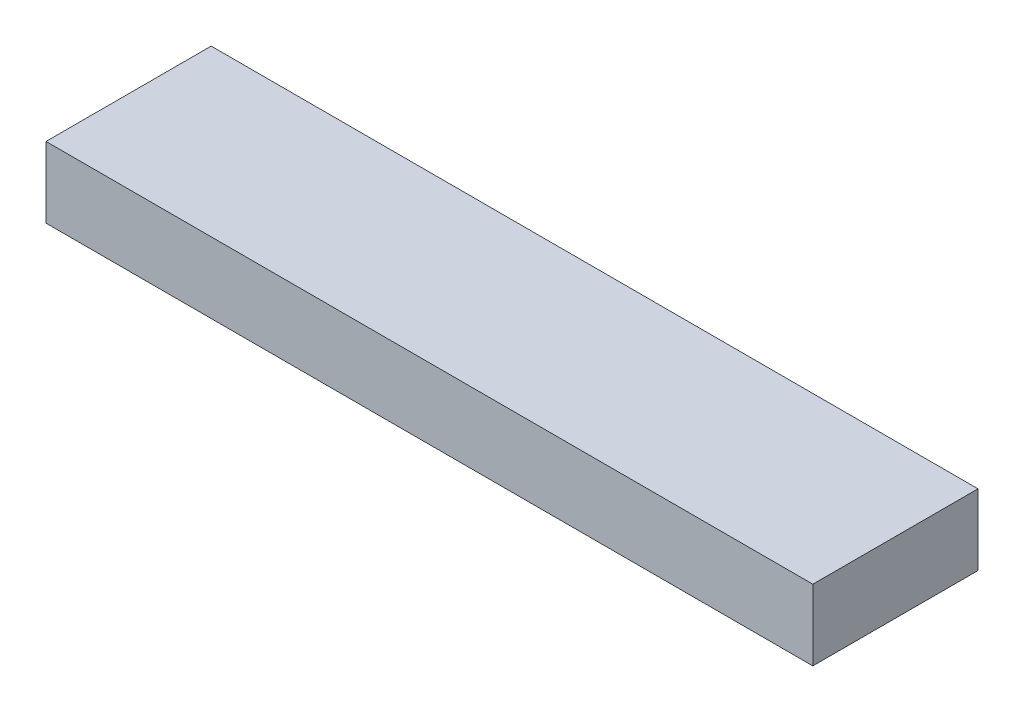
ISO-10303-21;
HEADER;
FILE_DESCRIPTION(('STEP AP214'),'2;1');
FILE_NAME('part.step','',(''),(''),'','','');
FILE_SCHEMA(('AUTOMOTIVE_DESIGN { 1 0 10303 214 1 1 1 1 }'));
ENDSEC;
DATA;
#1=APPLICATION_CONTEXT('core data for automotive mechanical design processes');
#2=APPLICATION_PROTOCOL_DEFINITION('international standard','automotive_design',2000,#1);
#3=PRODUCT_CONTEXT('',#1,'mechanical');
#4=PRODUCT('Part','Part','',(#3));
#5=PRODUCT_RELATED_PRODUCT_CATEGORY('part','',(#4));
#6=PRODUCT_DEFINITION_FORMATION('','',#4);
#7=PRODUCT_DEFINITION_CONTEXT('part definition',#1,'design');
#8=PRODUCT_DEFINITION('design','',#6,#7);
#9=PRODUCT_DEFINITION_SHAPE('','',#8);
#10=(LENGTH_UNIT() NAMED_UNIT(*) SI_UNIT(.MILLI.,.METRE.));
#11=(NAMED_UNIT(*) PLANE_ANGLE_UNIT() SI_UNIT($,.RADIAN.));
#12=(NAMED_UNIT(*) SI_UNIT($,.STERADIAN.) SOLID_ANGLE_UNIT());
#13=UNCERTAINTY_MEASURE_WITH_UNIT(LENGTH_MEASURE(1.E-05),#10,'distance_accuracy_value','');
#14=(GEOMETRIC_REPRESENTATION_CONTEXT(3) GLOBAL_UNCERTAINTY_ASSIGNED_CONTEXT((#13)) GLOBAL_UNIT_ASSIGNED_CONTEXT((#10,
#11,#12)) REPRESENTATION_CONTEXT('',''));
#15=CARTESIAN_POINT('',(0.,0.,0.));
#16=DIRECTION('',(0.,0.,1.));
#17=DIRECTION('',(1.,0.,0.));
#18=AXIS2_PLACEMENT_3D('',#15,#16,#17);
#19=CARTESIAN_POINT('',(0.,38.1,0.));
#20=DIRECTION('',(1.,0.,0.));
#21=DIRECTION('',(0.,0.,-1.));
#22=AXIS2_PLACEMENT_3D('',#19,#20,#21);
#23=PLANE('',#22);
#24=DIRECTION('',(0.,0.,1.));
#25=VECTOR('',#24,1.);
#26=CARTESIAN_POINT('',(0.,0.,0.));
#27=LINE('',#26,#25);
#28=CARTESIAN_POINT('',(0.,0.,0.));
#29=VERTEX_POINT('',#28);
#30=CARTESIAN_POINT('',(0.,0.,88.9));
#31=VERTEX_POINT('',#30);
#32=EDGE_CURVE('E96',#29,#31,#27,.T.);
#33=ORIENTED_EDGE('',*,*,#32,.T.);
#34=DIRECTION('',(0.,-1.,0.));
#35=VECTOR('',#34,1.);
#36=CARTESIAN_POINT('',(0.,38.1,88.9));
#37=LINE('',#36,#35);
#38=CARTESIAN_POINT('',(0.,38.1,88.9));
#39=VERTEX_POINT('',#38);
#40=EDGE_CURVE('E11',#39,#31,#37,.T.);
#41=ORIENTED_EDGE('',*,*,#40,.F.);
#42=DIRECTION('',(0.,0.,1.));
#43=VECTOR('',#42,1.);
#44=CARTESIAN_POINT('',(0.,38.1,0.));
#45=LINE('',#44,#43);
#46=CARTESIAN_POINT('',(0.,38.1,0.));
#47=VERTEX_POINT('',#46);
#48=EDGE_CURVE('E84',#47,#39,#45,.T.);
#49=ORIENTED_EDGE('',*,*,#48,.F.);
#50=DIRECTION('',(0.,-1.,0.));
#51=VECTOR('',#50,1.);
#52=CARTESIAN_POINT('',(0.,38.1,0.));
#53=LINE('',#52,#51);
#54=EDGE_CURVE('E92',#47,#29,#53,.T.);
#55=ORIENTED_EDGE('',*,*,#54,.T.);
#56=EDGE_LOOP('',(#33,#41,#49,#55));
#57=FACE_BOUND('',#56,.T.);
#58=ADVANCED_FACE('F33',(#57),#23,.F.);
#59=CARTESIAN_POINT('',(0.,38.1,88.9));
#60=DIRECTION('',(0.,0.,-1.));
#61=DIRECTION('',(-1.,0.,0.));
#62=AXIS2_PLACEMENT_3D('',#59,#60,#61);
#63=PLANE('',#62);
#64=DIRECTION('',(1.,0.,0.));
#65=VECTOR('',#64,1.);
#66=CARTESIAN_POINT('',(0.,0.,88.9));
#67=LINE('',#66,#65);
#68=CARTESIAN_POINT('',(412.75,0.,88.9));
#69=VERTEX_POINT('',#68);
#70=EDGE_CURVE('E88',#31,#69,#67,.T.);
#71=ORIENTED_EDGE('',*,*,#70,.T.);
#72=DIRECTION('',(0.,-1.,0.));
#73=VECTOR('',#72,1.);
#74=CARTESIAN_POINT('',(412.75,38.1,88.9));
#75=LINE('',#74,#73);
#76=CARTESIAN_POINT('',(412.75,38.1,88.9));
#77=VERTEX_POINT('',#76);
#78=EDGE_CURVE('E41',#77,#69,#75,.T.);
#79=ORIENTED_EDGE('',*,*,#78,.F.);
#80=DIRECTION('',(1.,0.,0.));
#81=VECTOR('',#80,1.);
#82=CARTESIAN_POINT('',(0.,38.1,88.9));
#83=LINE('',#82,#81);
#84=EDGE_CURVE('E79',#39,#77,#83,.T.);
#85=ORIENTED_EDGE('',*,*,#84,.F.);
#86=ORIENTED_EDGE('',*,*,#40,.T.);
#87=EDGE_LOOP('',(#71,#79,#85,#86));
#88=FACE_BOUND('',#87,.T.);
#89=ADVANCED_FACE('F87',(#88),#63,.F.);
#90=CARTESIAN_POINT('',(412.75,38.1,0.));
#91=DIRECTION('',(-1.,0.,0.));
#92=DIRECTION('',(0.,0.,1.));
#93=AXIS2_PLACEMENT_3D('',#90,#91,#92);
#94=PLANE('',#93);
#95=DIRECTION('',(0.,0.,-1.));
#96=VECTOR('',#95,1.);
#97=CARTESIAN_POINT('',(412.75,0.,0.));
#98=LINE('',#97,#96);
#99=CARTESIAN_POINT('',(412.75,0.,0.));
#100=VERTEX_POINT('',#99);
#101=EDGE_CURVE('E66',#69,#100,#98,.T.);
#102=ORIENTED_EDGE('',*,*,#101,.T.);
#103=DIRECTION('',(0.,-1.,0.));
#104=VECTOR('',#103,1.);
#105=CARTESIAN_POINT('',(412.75,38.1,0.));
#106=LINE('',#105,#104);
#107=CARTESIAN_POINT('',(412.75,38.1,0.));
#108=VERTEX_POINT('',#107);
#109=EDGE_CURVE('E89',#108,#100,#106,.T.);
#110=ORIENTED_EDGE('',*,*,#109,.F.);
#111=DIRECTION('',(0.,0.,-1.));
#112=VECTOR('',#111,1.);
#113=CARTESIAN_POINT('',(412.75,38.1,0.));
#114=LINE('',#113,#112);
#115=EDGE_CURVE('E82',#77,#108,#114,.T.);
#116=ORIENTED_EDGE('',*,*,#115,.F.);
#117=ORIENTED_EDGE('',*,*,#78,.T.);
#118=EDGE_LOOP('',(#102,#110,#116,#117));
#119=FACE_BOUND('',#118,.T.);
#120=ADVANCED_FACE('F90',(#119),#94,.F.);
#121=CARTESIAN_POINT('',(0.,38.1,0.));
#122=DIRECTION('',(0.,0.,1.));
#123=DIRECTION('',(1.,0.,0.));
#124=AXIS2_PLACEMENT_3D('',#121,#122,#123);
#125=PLANE('',#124);
#126=DIRECTION('',(-1.,0.,0.));
#127=VECTOR('',#126,1.);
#128=CARTESIAN_POINT('',(0.,0.,0.));
#129=LINE('',#128,#127);
#130=EDGE_CURVE('E72',#100,#29,#129,.T.);
#131=ORIENTED_EDGE('',*,*,#130,.T.);
#132=ORIENTED_EDGE('',*,*,#54,.F.);
#133=DIRECTION('',(-1.,0.,0.));
#134=VECTOR('',#133,1.);
#135=CARTESIAN_POINT('',(0.,38.1,0.));
#136=LINE('',#135,#134);
#137=EDGE_CURVE('E49',#108,#47,#136,.T.);
#138=ORIENTED_EDGE('',*,*,#137,.F.);
#139=ORIENTED_EDGE('',*,*,#109,.T.);
#140=EDGE_LOOP('',(#131,#132,#138,#139));
#141=FACE_BOUND('',#140,.T.);
#142=ADVANCED_FACE('F103',(#141),#125,.F.);
#143=CARTESIAN_POINT('',(0.,38.1,0.));
#144=DIRECTION('',(0.,1.,0.));
#145=DIRECTION('',(0.,0.,1.));
#146=AXIS2_PLACEMENT_3D('',#143,#144,#145);
#147=PLANE('',#146);
#148=ORIENTED_EDGE('',*,*,#48,.T.);
#149=ORIENTED_EDGE('',*,*,#84,.T.);
#150=ORIENTED_EDGE('',*,*,#115,.T.);
#151=ORIENTED_EDGE('',*,*,#137,.T.);
#152=EDGE_LOOP('',(#148,#149,#150,#151));
#153=FACE_BOUND('',#152,.T.);
#154=ADVANCED_FACE('F80',(#153),#147,.T.);
#155=CARTESIAN_POINT('',(0.,0.,0.));
#156=DIRECTION('',(0.,1.,0.));
#157=DIRECTION('',(0.,0.,1.));
#158=AXIS2_PLACEMENT_3D('',#155,#156,#157);
#159=PLANE('',#158);
#160=ORIENTED_EDGE('',*,*,#32,.F.);
#161=ORIENTED_EDGE('',*,*,#130,.F.);
#162=ORIENTED_EDGE('',*,*,#101,.F.);
#163=ORIENTED_EDGE('',*,*,#70,.F.);
#164=EDGE_LOOP('',(#160,#161,#162,#163));
#165=FACE_BOUND('',#164,.T.);
#166=ADVANCED_FACE('F106',(#165),#159,.F.);
#167=CLOSED_SHELL('',(#58,#89,#120,#142,#154,#166));
#168=MANIFOLD_SOLID_BREP('B2',#167);
#169=ADVANCED_BREP_SHAPE_REPRESENTATION('',(#18,#168),#14);
#170=SHAPE_DEFINITION_REPRESENTATION(#9,#169);
ENDSEC;
END-ISO-10303-21;
